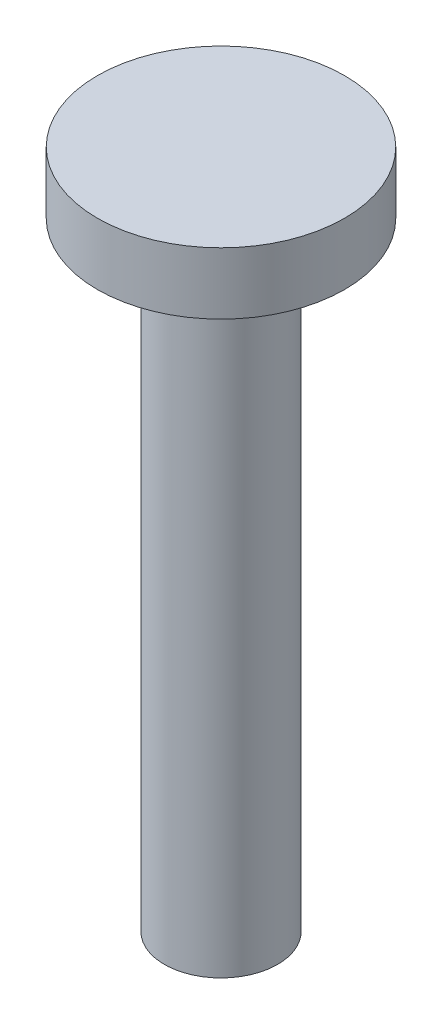
ISO-10303-21;
HEADER;
FILE_DESCRIPTION(('STEP AP214'),'2;1');
FILE_NAME('part.step','',(''),(''),'','','');
FILE_SCHEMA(('AUTOMOTIVE_DESIGN { 1 0 10303 214 1 1 1 1 }'));
ENDSEC;
DATA;
#1=APPLICATION_CONTEXT('core data for automotive mechanical design processes');
#2=APPLICATION_PROTOCOL_DEFINITION('international standard','automotive_design',2000,#1);
#3=PRODUCT_CONTEXT('',#1,'mechanical');
#4=PRODUCT('Part','Part','',(#3));
#5=PRODUCT_RELATED_PRODUCT_CATEGORY('part','',(#4));
#6=PRODUCT_DEFINITION_FORMATION('','',#4);
#7=PRODUCT_DEFINITION_CONTEXT('part definition',#1,'design');
#8=PRODUCT_DEFINITION('design','',#6,#7);
#9=PRODUCT_DEFINITION_SHAPE('','',#8);
#10=(LENGTH_UNIT() NAMED_UNIT(*) SI_UNIT(.MILLI.,.METRE.));
#11=(NAMED_UNIT(*) PLANE_ANGLE_UNIT() SI_UNIT($,.RADIAN.));
#12=(NAMED_UNIT(*) SI_UNIT($,.STERADIAN.) SOLID_ANGLE_UNIT());
#13=UNCERTAINTY_MEASURE_WITH_UNIT(LENGTH_MEASURE(1.E-05),#10,'distance_accuracy_value','');
#14=(GEOMETRIC_REPRESENTATION_CONTEXT(3) GLOBAL_UNCERTAINTY_ASSIGNED_CONTEXT((#13)) GLOBAL_UNIT_ASSIGNED_CONTEXT((#10,
#11,#12)) REPRESENTATION_CONTEXT('',''));
#15=CARTESIAN_POINT('',(0.,0.,0.));
#16=DIRECTION('',(0.,0.,1.));
#17=DIRECTION('',(1.,0.,0.));
#18=AXIS2_PLACEMENT_3D('',#15,#16,#17);
#19=CARTESIAN_POINT('',(0.,61.5,0.));
#20=DIRECTION('',(0.,-1.,0.));
#21=DIRECTION('',(0.,0.,-1.));
#22=AXIS2_PLACEMENT_3D('',#19,#20,#21);
#23=CYLINDRICAL_SURFACE('',#22,6.);
#24=CARTESIAN_POINT('',(0.,61.5,0.));
#25=DIRECTION('',(0.,1.,0.));
#26=DIRECTION('',(0.,0.,1.));
#27=AXIS2_PLACEMENT_3D('',#24,#25,#26);
#28=CIRCLE('',#27,6.);
#29=CARTESIAN_POINT('',(0.,61.5,6.));
#30=VERTEX_POINT('',#29);
#31=EDGE_CURVE('E10',#30,#30,#28,.T.);
#32=ORIENTED_EDGE('',*,*,#31,.F.);
#33=EDGE_LOOP('',(#32));
#34=FACE_BOUND('',#33,.T.);
#35=CARTESIAN_POINT('',(0.,58.5,0.));
#36=DIRECTION('',(0.,1.,0.));
#37=DIRECTION('',(0.,0.,1.));
#38=AXIS2_PLACEMENT_3D('',#35,#36,#37);
#39=CIRCLE('',#38,6.);
#40=CARTESIAN_POINT('',(0.,58.5,6.));
#41=VERTEX_POINT('',#40);
#42=EDGE_CURVE('E35',#41,#41,#39,.T.);
#43=ORIENTED_EDGE('',*,*,#42,.T.);
#44=EDGE_LOOP('',(#43));
#45=FACE_BOUND('',#44,.T.);
#46=ADVANCED_FACE('F32',(#34,#45),#23,.T.);
#47=CARTESIAN_POINT('',(0.,61.5,0.));
#48=DIRECTION('',(0.,1.,0.));
#49=DIRECTION('',(0.,0.,1.));
#50=AXIS2_PLACEMENT_3D('',#47,#48,#49);
#51=PLANE('',#50);
#52=ORIENTED_EDGE('',*,*,#31,.T.);
#53=EDGE_LOOP('',(#52));
#54=FACE_BOUND('',#53,.T.);
#55=ADVANCED_FACE('F60',(#54),#51,.T.);
#56=CARTESIAN_POINT('',(0.,58.5,0.));
#57=DIRECTION('',(0.,1.,0.));
#58=DIRECTION('',(0.,0.,1.));
#59=AXIS2_PLACEMENT_3D('',#56,#57,#58);
#60=PLANE('',#59);
#61=ORIENTED_EDGE('',*,*,#42,.F.);
#62=EDGE_LOOP('',(#61));
#63=FACE_BOUND('',#62,.T.);
#64=CARTESIAN_POINT('',(0.,58.5,0.));
#65=DIRECTION('',(0.,1.,0.));
#66=DIRECTION('',(0.,0.,1.));
#67=AXIS2_PLACEMENT_3D('',#64,#65,#66);
#68=CIRCLE('',#67,2.75);
#69=CARTESIAN_POINT('',(0.,58.5,2.75));
#70=VERTEX_POINT('',#69);
#71=EDGE_CURVE('E42',#70,#70,#68,.F.);
#72=ORIENTED_EDGE('',*,*,#71,.F.);
#73=EDGE_LOOP('',(#72));
#74=FACE_BOUND('',#73,.T.);
#75=ADVANCED_FACE('F55',(#63,#74),#60,.F.);
#76=CARTESIAN_POINT('',(0.,66.9852813742386,0.));
#77=DIRECTION('',(0.,-1.,0.));
#78=DIRECTION('',(0.,0.,-1.));
#79=AXIS2_PLACEMENT_3D('',#76,#77,#78);
#80=CYLINDRICAL_SURFACE('',#79,2.75);
#81=CARTESIAN_POINT('',(0.,28.5,0.));
#82=DIRECTION('',(0.,-1.,0.));
#83=DIRECTION('',(0.,0.,-1.));
#84=AXIS2_PLACEMENT_3D('',#81,#82,#83);
#85=CIRCLE('',#84,2.75);
#86=CARTESIAN_POINT('',(0.,28.5,-2.75));
#87=VERTEX_POINT('',#86);
#88=EDGE_CURVE('E46',#87,#87,#85,.T.);
#89=ORIENTED_EDGE('',*,*,#88,.F.);
#90=EDGE_LOOP('',(#89));
#91=FACE_BOUND('',#90,.T.);
#92=ORIENTED_EDGE('',*,*,#71,.T.);
#93=EDGE_LOOP('',(#92));
#94=FACE_BOUND('',#93,.T.);
#95=ADVANCED_FACE('F52',(#91,#94),#80,.T.);
#96=CARTESIAN_POINT('',(0.,28.5,0.));
#97=DIRECTION('',(0.,-1.,0.));
#98=DIRECTION('',(0.,0.,-1.));
#99=AXIS2_PLACEMENT_3D('',#96,#97,#98);
#100=PLANE('',#99);
#101=ORIENTED_EDGE('',*,*,#88,.T.);
#102=EDGE_LOOP('',(#101));
#103=FACE_BOUND('',#102,.T.);
#104=ADVANCED_FACE('F50',(#103),#100,.T.);
#105=CLOSED_SHELL('',(#46,#55,#75,#95,#104));
#106=MANIFOLD_SOLID_BREP('B2',#105);
#107=ADVANCED_BREP_SHAPE_REPRESENTATION('',(#18,#106),#14);
#108=SHAPE_DEFINITION_REPRESENTATION(#9,#107);
ENDSEC;
END-ISO-10303-21;
